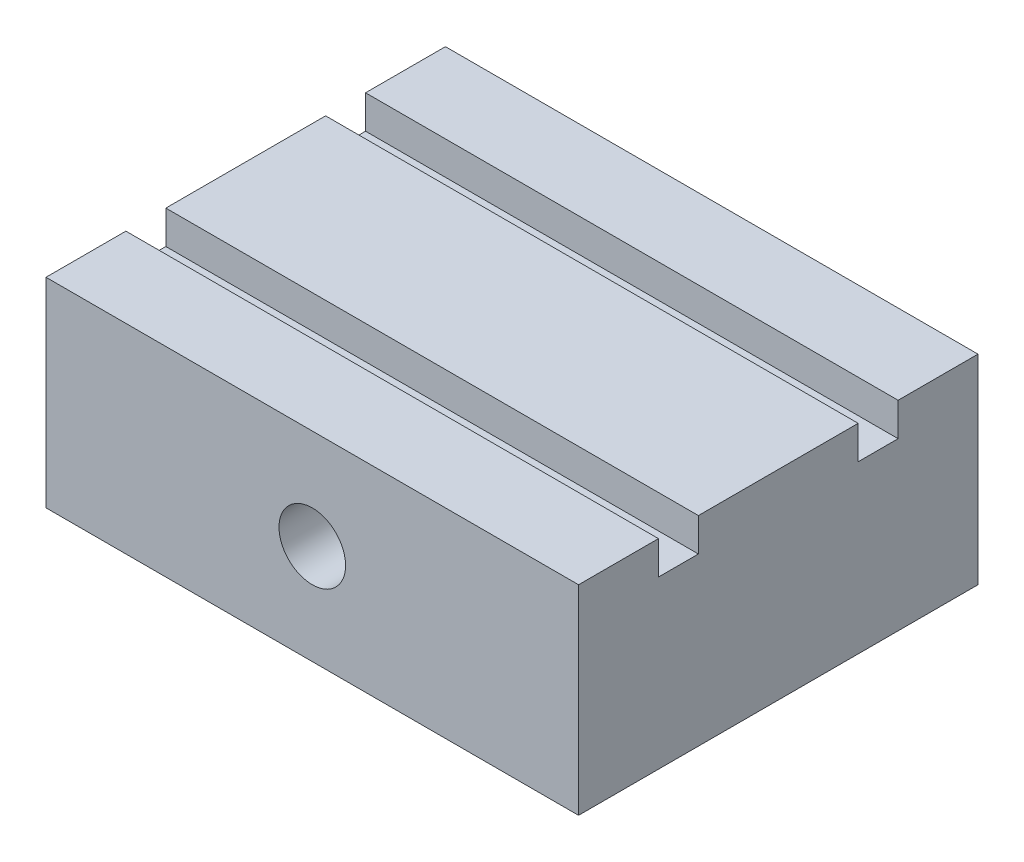
ISO-10303-21;
HEADER;
FILE_DESCRIPTION(('STEP AP214'),'2;1');
FILE_NAME('part.step','',(''),(''),'','','');
FILE_SCHEMA(('AUTOMOTIVE_DESIGN { 1 0 10303 214 1 1 1 1 }'));
ENDSEC;
DATA;
#1=APPLICATION_CONTEXT('core data for automotive mechanical design processes');
#2=APPLICATION_PROTOCOL_DEFINITION('international standard','automotive_design',2000,#1);
#3=PRODUCT_CONTEXT('',#1,'mechanical');
#4=PRODUCT('Part','Part','',(#3));
#5=PRODUCT_RELATED_PRODUCT_CATEGORY('part','',(#4));
#6=PRODUCT_DEFINITION_FORMATION('','',#4);
#7=PRODUCT_DEFINITION_CONTEXT('part definition',#1,'design');
#8=PRODUCT_DEFINITION('design','',#6,#7);
#9=PRODUCT_DEFINITION_SHAPE('','',#8);
#10=(LENGTH_UNIT() NAMED_UNIT(*) SI_UNIT(.MILLI.,.METRE.));
#11=(NAMED_UNIT(*) PLANE_ANGLE_UNIT() SI_UNIT($,.RADIAN.));
#12=(NAMED_UNIT(*) SI_UNIT($,.STERADIAN.) SOLID_ANGLE_UNIT());
#13=UNCERTAINTY_MEASURE_WITH_UNIT(LENGTH_MEASURE(1.E-05),#10,'distance_accuracy_value','');
#14=(GEOMETRIC_REPRESENTATION_CONTEXT(3) GLOBAL_UNCERTAINTY_ASSIGNED_CONTEXT((#13)) GLOBAL_UNIT_ASSIGNED_CONTEXT((#10,
#11,#12)) REPRESENTATION_CONTEXT('',''));
#15=CARTESIAN_POINT('',(0.,0.,0.));
#16=DIRECTION('',(0.,0.,1.));
#17=DIRECTION('',(1.,0.,0.));
#18=AXIS2_PLACEMENT_3D('',#15,#16,#17);
#19=CARTESIAN_POINT('',(0.,30.,0.));
#20=DIRECTION('',(0.,1.,0.));
#21=DIRECTION('',(0.,0.,1.));
#22=AXIS2_PLACEMENT_3D('',#19,#20,#21);
#23=PLANE('',#22);
#24=DIRECTION('',(-1.,0.,0.));
#25=VECTOR('',#24,1.);
#26=CARTESIAN_POINT('',(-40.,30.,-18.));
#27=LINE('',#26,#25);
#28=CARTESIAN_POINT('',(40.,30.,-18.));
#29=VERTEX_POINT('',#28);
#30=CARTESIAN_POINT('',(-40.,30.,-18.));
#31=VERTEX_POINT('',#30);
#32=EDGE_CURVE('E145',#29,#31,#27,.T.);
#33=ORIENTED_EDGE('',*,*,#32,.F.);
#34=DIRECTION('',(0.,0.,-1.));
#35=VECTOR('',#34,1.);
#36=CARTESIAN_POINT('',(40.,30.,-30.));
#37=LINE('',#36,#35);
#38=CARTESIAN_POINT('',(40.,30.,-30.));
#39=VERTEX_POINT('',#38);
#40=EDGE_CURVE('E211',#29,#39,#37,.T.);
#41=ORIENTED_EDGE('',*,*,#40,.T.);
#42=DIRECTION('',(-1.,0.,0.));
#43=VECTOR('',#42,1.);
#44=CARTESIAN_POINT('',(-40.,30.,-30.));
#45=LINE('',#44,#43);
#46=CARTESIAN_POINT('',(-40.,30.,-30.));
#47=VERTEX_POINT('',#46);
#48=EDGE_CURVE('E209',#39,#47,#45,.T.);
#49=ORIENTED_EDGE('',*,*,#48,.T.);
#50=DIRECTION('',(0.,0.,1.));
#51=VECTOR('',#50,1.);
#52=CARTESIAN_POINT('',(-40.,30.,-30.));
#53=LINE('',#52,#51);
#54=EDGE_CURVE('E215',#47,#31,#53,.T.);
#55=ORIENTED_EDGE('',*,*,#54,.T.);
#56=EDGE_LOOP('',(#33,#41,#49,#55));
#57=FACE_BOUND('',#56,.T.);
#58=ADVANCED_FACE('F38',(#57),#23,.T.);
#59=DIRECTION('',(1.,0.,0.));
#60=VECTOR('',#59,1.);
#61=CARTESIAN_POINT('',(-40.,30.,-12.));
#62=LINE('',#61,#60);
#63=CARTESIAN_POINT('',(-40.,30.,-12.));
#64=VERTEX_POINT('',#63);
#65=CARTESIAN_POINT('',(40.,30.,-12.));
#66=VERTEX_POINT('',#65);
#67=EDGE_CURVE('E185',#64,#66,#62,.T.);
#68=ORIENTED_EDGE('',*,*,#67,.F.);
#69=CARTESIAN_POINT('',(-40.,30.,12.));
#70=VERTEX_POINT('',#69);
#71=EDGE_CURVE('E151',#64,#70,#53,.T.);
#72=ORIENTED_EDGE('',*,*,#71,.T.);
#73=DIRECTION('',(-1.,0.,0.));
#74=VECTOR('',#73,1.);
#75=CARTESIAN_POINT('',(-40.,30.,12.));
#76=LINE('',#75,#74);
#77=CARTESIAN_POINT('',(40.,30.,12.));
#78=VERTEX_POINT('',#77);
#79=EDGE_CURVE('E166',#78,#70,#76,.T.);
#80=ORIENTED_EDGE('',*,*,#79,.F.);
#81=EDGE_CURVE('E210',#78,#66,#37,.T.);
#82=ORIENTED_EDGE('',*,*,#81,.T.);
#83=EDGE_LOOP('',(#68,#72,#80,#82));
#84=FACE_BOUND('',#83,.T.);
#85=ADVANCED_FACE('F269',(#84),#23,.T.);
#86=CARTESIAN_POINT('',(40.,30.,-30.));
#87=DIRECTION('',(-1.,0.,0.));
#88=DIRECTION('',(0.,0.,1.));
#89=AXIS2_PLACEMENT_3D('',#86,#87,#88);
#90=PLANE('',#89);
#91=ORIENTED_EDGE('',*,*,#40,.F.);
#92=DIRECTION('',(0.,1.,0.));
#93=VECTOR('',#92,1.);
#94=CARTESIAN_POINT('',(40.,25.,-18.));
#95=LINE('',#94,#93);
#96=CARTESIAN_POINT('',(40.,25.,-18.));
#97=VERTEX_POINT('',#96);
#98=EDGE_CURVE('E156',#97,#29,#95,.T.);
#99=ORIENTED_EDGE('',*,*,#98,.F.);
#100=DIRECTION('',(0.,0.,-1.));
#101=VECTOR('',#100,1.);
#102=CARTESIAN_POINT('',(40.,25.,-18.));
#103=LINE('',#102,#101);
#104=CARTESIAN_POINT('',(40.,25.,-12.));
#105=VERTEX_POINT('',#104);
#106=EDGE_CURVE('E134',#105,#97,#103,.T.);
#107=ORIENTED_EDGE('',*,*,#106,.F.);
#108=DIRECTION('',(0.,1.,0.));
#109=VECTOR('',#108,1.);
#110=CARTESIAN_POINT('',(40.,25.,-12.));
#111=LINE('',#110,#109);
#112=EDGE_CURVE('E130',#105,#66,#111,.T.);
#113=ORIENTED_EDGE('',*,*,#112,.T.);
#114=ORIENTED_EDGE('',*,*,#81,.F.);
#115=DIRECTION('',(0.,1.,0.));
#116=VECTOR('',#115,1.);
#117=CARTESIAN_POINT('',(40.,25.,12.));
#118=LINE('',#117,#116);
#119=CARTESIAN_POINT('',(40.,25.,12.));
#120=VERTEX_POINT('',#119);
#121=EDGE_CURVE('E186',#120,#78,#118,.T.);
#122=ORIENTED_EDGE('',*,*,#121,.F.);
#123=DIRECTION('',(0.,0.,-1.));
#124=VECTOR('',#123,1.);
#125=CARTESIAN_POINT('',(40.,25.,18.));
#126=LINE('',#125,#124);
#127=CARTESIAN_POINT('',(40.,25.,18.));
#128=VERTEX_POINT('',#127);
#129=EDGE_CURVE('E170',#128,#120,#126,.T.);
#130=ORIENTED_EDGE('',*,*,#129,.F.);
#131=DIRECTION('',(0.,1.,0.));
#132=VECTOR('',#131,1.);
#133=CARTESIAN_POINT('',(40.,25.,18.));
#134=LINE('',#133,#132);
#135=CARTESIAN_POINT('',(40.,30.,18.));
#136=VERTEX_POINT('',#135);
#137=EDGE_CURVE('E189',#128,#136,#134,.T.);
#138=ORIENTED_EDGE('',*,*,#137,.T.);
#139=CARTESIAN_POINT('',(40.,30.,30.));
#140=VERTEX_POINT('',#139);
#141=EDGE_CURVE('E205',#140,#136,#37,.T.);
#142=ORIENTED_EDGE('',*,*,#141,.F.);
#143=DIRECTION('',(0.,-1.,0.));
#144=VECTOR('',#143,1.);
#145=CARTESIAN_POINT('',(40.,30.,30.));
#146=LINE('',#145,#144);
#147=CARTESIAN_POINT('',(40.,0.,30.));
#148=VERTEX_POINT('',#147);
#149=EDGE_CURVE('E222',#140,#148,#146,.T.);
#150=ORIENTED_EDGE('',*,*,#149,.T.);
#151=DIRECTION('',(0.,0.,-1.));
#152=VECTOR('',#151,1.);
#153=CARTESIAN_POINT('',(40.,0.,-30.));
#154=LINE('',#153,#152);
#155=CARTESIAN_POINT('',(40.,0.,-30.));
#156=VERTEX_POINT('',#155);
#157=EDGE_CURVE('E199',#148,#156,#154,.T.);
#158=ORIENTED_EDGE('',*,*,#157,.T.);
#159=DIRECTION('',(0.,-1.,0.));
#160=VECTOR('',#159,1.);
#161=CARTESIAN_POINT('',(40.,30.,-30.));
#162=LINE('',#161,#160);
#163=EDGE_CURVE('E11',#39,#156,#162,.T.);
#164=ORIENTED_EDGE('',*,*,#163,.F.);
#165=EDGE_LOOP('',(#91,#99,#107,#113,#114,#122,#130,#138,#142,#150,#158,#164));
#166=FACE_BOUND('',#165,.T.);
#167=ADVANCED_FACE('F40',(#166),#90,.F.);
#168=CARTESIAN_POINT('',(-40.,30.,-30.));
#169=DIRECTION('',(0.,0.,1.));
#170=DIRECTION('',(1.,0.,0.));
#171=AXIS2_PLACEMENT_3D('',#168,#169,#170);
#172=PLANE('',#171);
#173=CARTESIAN_POINT('',(0.,15.,-30.));
#174=DIRECTION('',(0.,0.,1.));
#175=DIRECTION('',(1.,0.,0.));
#176=AXIS2_PLACEMENT_3D('',#173,#174,#175);
#177=CIRCLE('',#176,5.);
#178=CARTESIAN_POINT('',(4.99999999999999,15.,-30.));
#179=VERTEX_POINT('',#178);
#180=EDGE_CURVE('E195',#179,#179,#177,.T.);
#181=ORIENTED_EDGE('',*,*,#180,.T.);
#182=EDGE_LOOP('',(#181));
#183=FACE_BOUND('',#182,.T.);
#184=DIRECTION('',(-1.,0.,0.));
#185=VECTOR('',#184,1.);
#186=CARTESIAN_POINT('',(-40.,0.,-30.));
#187=LINE('',#186,#185);
#188=CARTESIAN_POINT('',(-40.,0.,-30.));
#189=VERTEX_POINT('',#188);
#190=EDGE_CURVE('E226',#156,#189,#187,.T.);
#191=ORIENTED_EDGE('',*,*,#190,.T.);
#192=DIRECTION('',(0.,-1.,0.));
#193=VECTOR('',#192,1.);
#194=CARTESIAN_POINT('',(-40.,30.,-30.));
#195=LINE('',#194,#193);
#196=EDGE_CURVE('E47',#47,#189,#195,.T.);
#197=ORIENTED_EDGE('',*,*,#196,.F.);
#198=ORIENTED_EDGE('',*,*,#48,.F.);
#199=ORIENTED_EDGE('',*,*,#163,.T.);
#200=EDGE_LOOP('',(#191,#197,#198,#199));
#201=FACE_BOUND('',#200,.T.);
#202=ADVANCED_FACE('F287',(#183,#201),#172,.F.);
#203=CARTESIAN_POINT('',(-40.,30.,-30.));
#204=DIRECTION('',(1.,0.,0.));
#205=DIRECTION('',(0.,0.,-1.));
#206=AXIS2_PLACEMENT_3D('',#203,#204,#205);
#207=PLANE('',#206);
#208=DIRECTION('',(0.,0.,1.));
#209=VECTOR('',#208,1.);
#210=CARTESIAN_POINT('',(-40.,25.,-18.));
#211=LINE('',#210,#209);
#212=CARTESIAN_POINT('',(-40.,25.,-18.));
#213=VERTEX_POINT('',#212);
#214=CARTESIAN_POINT('',(-40.,25.,-12.));
#215=VERTEX_POINT('',#214);
#216=EDGE_CURVE('E135',#213,#215,#211,.T.);
#217=ORIENTED_EDGE('',*,*,#216,.F.);
#218=DIRECTION('',(0.,1.,0.));
#219=VECTOR('',#218,1.);
#220=CARTESIAN_POINT('',(-40.,25.,-18.));
#221=LINE('',#220,#219);
#222=EDGE_CURVE('E204',#213,#31,#221,.T.);
#223=ORIENTED_EDGE('',*,*,#222,.T.);
#224=ORIENTED_EDGE('',*,*,#54,.F.);
#225=ORIENTED_EDGE('',*,*,#196,.T.);
#226=DIRECTION('',(0.,0.,1.));
#227=VECTOR('',#226,1.);
#228=CARTESIAN_POINT('',(-40.,0.,-30.));
#229=LINE('',#228,#227);
#230=CARTESIAN_POINT('',(-40.,0.,30.));
#231=VERTEX_POINT('',#230);
#232=EDGE_CURVE('E229',#189,#231,#229,.T.);
#233=ORIENTED_EDGE('',*,*,#232,.T.);
#234=DIRECTION('',(0.,-1.,0.));
#235=VECTOR('',#234,1.);
#236=CARTESIAN_POINT('',(-40.,30.,30.));
#237=LINE('',#236,#235);
#238=CARTESIAN_POINT('',(-40.,30.,30.));
#239=VERTEX_POINT('',#238);
#240=EDGE_CURVE('E238',#239,#231,#237,.T.);
#241=ORIENTED_EDGE('',*,*,#240,.F.);
#242=CARTESIAN_POINT('',(-40.,30.,18.));
#243=VERTEX_POINT('',#242);
#244=EDGE_CURVE('E214',#243,#239,#53,.T.);
#245=ORIENTED_EDGE('',*,*,#244,.F.);
#246=DIRECTION('',(0.,1.,0.));
#247=VECTOR('',#246,1.);
#248=CARTESIAN_POINT('',(-40.,25.,18.));
#249=LINE('',#248,#247);
#250=CARTESIAN_POINT('',(-40.,25.,18.));
#251=VERTEX_POINT('',#250);
#252=EDGE_CURVE('E54',#251,#243,#249,.T.);
#253=ORIENTED_EDGE('',*,*,#252,.F.);
#254=DIRECTION('',(0.,0.,1.));
#255=VECTOR('',#254,1.);
#256=CARTESIAN_POINT('',(-40.,25.,18.));
#257=LINE('',#256,#255);
#258=CARTESIAN_POINT('',(-40.,25.,12.));
#259=VERTEX_POINT('',#258);
#260=EDGE_CURVE('E161',#259,#251,#257,.T.);
#261=ORIENTED_EDGE('',*,*,#260,.F.);
#262=DIRECTION('',(0.,1.,0.));
#263=VECTOR('',#262,1.);
#264=CARTESIAN_POINT('',(-40.,25.,12.));
#265=LINE('',#264,#263);
#266=EDGE_CURVE('E182',#259,#70,#265,.T.);
#267=ORIENTED_EDGE('',*,*,#266,.T.);
#268=ORIENTED_EDGE('',*,*,#71,.F.);
#269=DIRECTION('',(0.,1.,0.));
#270=VECTOR('',#269,1.);
#271=CARTESIAN_POINT('',(-40.,25.,-12.));
#272=LINE('',#271,#270);
#273=EDGE_CURVE('E62',#215,#64,#272,.T.);
#274=ORIENTED_EDGE('',*,*,#273,.F.);
#275=EDGE_LOOP('',(#217,#223,#224,#225,#233,#241,#245,#253,#261,#267,#268,#274));
#276=FACE_BOUND('',#275,.T.);
#277=ADVANCED_FACE('F148',(#276),#207,.F.);
#278=CARTESIAN_POINT('',(-40.,30.,30.));
#279=DIRECTION('',(0.,0.,-1.));
#280=DIRECTION('',(-1.,0.,0.));
#281=AXIS2_PLACEMENT_3D('',#278,#279,#280);
#282=PLANE('',#281);
#283=CARTESIAN_POINT('',(0.,15.,30.));
#284=DIRECTION('',(0.,0.,1.));
#285=DIRECTION('',(1.,0.,0.));
#286=AXIS2_PLACEMENT_3D('',#283,#284,#285);
#287=CIRCLE('',#286,5.);
#288=CARTESIAN_POINT('',(4.99999999999999,15.,30.));
#289=VERTEX_POINT('',#288);
#290=EDGE_CURVE('E200',#289,#289,#287,.T.);
#291=ORIENTED_EDGE('',*,*,#290,.F.);
#292=EDGE_LOOP('',(#291));
#293=FACE_BOUND('',#292,.T.);
#294=DIRECTION('',(1.,0.,0.));
#295=VECTOR('',#294,1.);
#296=CARTESIAN_POINT('',(-40.,0.,30.));
#297=LINE('',#296,#295);
#298=EDGE_CURVE('E232',#231,#148,#297,.T.);
#299=ORIENTED_EDGE('',*,*,#298,.T.);
#300=ORIENTED_EDGE('',*,*,#149,.F.);
#301=DIRECTION('',(1.,0.,0.));
#302=VECTOR('',#301,1.);
#303=CARTESIAN_POINT('',(-40.,30.,30.));
#304=LINE('',#303,#302);
#305=EDGE_CURVE('E219',#239,#140,#304,.T.);
#306=ORIENTED_EDGE('',*,*,#305,.F.);
#307=ORIENTED_EDGE('',*,*,#240,.T.);
#308=EDGE_LOOP('',(#299,#300,#306,#307));
#309=FACE_BOUND('',#308,.T.);
#310=ADVANCED_FACE('F255',(#293,#309),#282,.F.);
#311=DIRECTION('',(1.,0.,0.));
#312=VECTOR('',#311,1.);
#313=CARTESIAN_POINT('',(-40.,30.,18.));
#314=LINE('',#313,#312);
#315=EDGE_CURVE('E177',#243,#136,#314,.T.);
#316=ORIENTED_EDGE('',*,*,#315,.F.);
#317=ORIENTED_EDGE('',*,*,#244,.T.);
#318=ORIENTED_EDGE('',*,*,#305,.T.);
#319=ORIENTED_EDGE('',*,*,#141,.T.);
#320=EDGE_LOOP('',(#316,#317,#318,#319));
#321=FACE_BOUND('',#320,.T.);
#322=ADVANCED_FACE('F263',(#321),#23,.T.);
#323=CARTESIAN_POINT('',(0.,0.,0.));
#324=DIRECTION('',(0.,1.,0.));
#325=DIRECTION('',(0.,0.,1.));
#326=AXIS2_PLACEMENT_3D('',#323,#324,#325);
#327=PLANE('',#326);
#328=ORIENTED_EDGE('',*,*,#157,.F.);
#329=ORIENTED_EDGE('',*,*,#298,.F.);
#330=ORIENTED_EDGE('',*,*,#232,.F.);
#331=ORIENTED_EDGE('',*,*,#190,.F.);
#332=EDGE_LOOP('',(#328,#329,#330,#331));
#333=FACE_BOUND('',#332,.T.);
#334=ADVANCED_FACE('F252',(#333),#327,.F.);
#335=CARTESIAN_POINT('',(0.,15.,-30.));
#336=DIRECTION('',(0.,0.,1.));
#337=DIRECTION('',(1.,0.,0.));
#338=AXIS2_PLACEMENT_3D('',#335,#336,#337);
#339=CYLINDRICAL_SURFACE('',#338,5.);
#340=ORIENTED_EDGE('',*,*,#180,.F.);
#341=EDGE_LOOP('',(#340));
#342=FACE_BOUND('',#341,.T.);
#343=ORIENTED_EDGE('',*,*,#290,.T.);
#344=EDGE_LOOP('',(#343));
#345=FACE_BOUND('',#344,.T.);
#346=ADVANCED_FACE('F310',(#342,#345),#339,.F.);
#347=CARTESIAN_POINT('',(-40.,25.,12.));
#348=DIRECTION('',(0.,0.,-1.));
#349=DIRECTION('',(-1.,0.,0.));
#350=AXIS2_PLACEMENT_3D('',#347,#348,#349);
#351=PLANE('',#350);
#352=ORIENTED_EDGE('',*,*,#79,.T.);
#353=ORIENTED_EDGE('',*,*,#266,.F.);
#354=DIRECTION('',(-1.,0.,0.));
#355=VECTOR('',#354,1.);
#356=CARTESIAN_POINT('',(-40.,25.,12.));
#357=LINE('',#356,#355);
#358=EDGE_CURVE('E173',#120,#259,#357,.T.);
#359=ORIENTED_EDGE('',*,*,#358,.F.);
#360=ORIENTED_EDGE('',*,*,#121,.T.);
#361=EDGE_LOOP('',(#352,#353,#359,#360));
#362=FACE_BOUND('',#361,.T.);
#363=ADVANCED_FACE('F319',(#362),#351,.F.);
#364=CARTESIAN_POINT('',(-40.,25.,18.));
#365=DIRECTION('',(0.,0.,1.));
#366=DIRECTION('',(1.,0.,0.));
#367=AXIS2_PLACEMENT_3D('',#364,#365,#366);
#368=PLANE('',#367);
#369=ORIENTED_EDGE('',*,*,#315,.T.);
#370=ORIENTED_EDGE('',*,*,#137,.F.);
#371=DIRECTION('',(1.,0.,0.));
#372=VECTOR('',#371,1.);
#373=CARTESIAN_POINT('',(-40.,25.,18.));
#374=LINE('',#373,#372);
#375=EDGE_CURVE('E165',#251,#128,#374,.T.);
#376=ORIENTED_EDGE('',*,*,#375,.F.);
#377=ORIENTED_EDGE('',*,*,#252,.T.);
#378=EDGE_LOOP('',(#369,#370,#376,#377));
#379=FACE_BOUND('',#378,.T.);
#380=ADVANCED_FACE('F324',(#379),#368,.F.);
#381=CARTESIAN_POINT('',(0.,25.,0.));
#382=DIRECTION('',(0.,-1.,0.));
#383=DIRECTION('',(0.,0.,-1.));
#384=AXIS2_PLACEMENT_3D('',#381,#382,#383);
#385=PLANE('',#384);
#386=ORIENTED_EDGE('',*,*,#260,.T.);
#387=ORIENTED_EDGE('',*,*,#375,.T.);
#388=ORIENTED_EDGE('',*,*,#129,.T.);
#389=ORIENTED_EDGE('',*,*,#358,.T.);
#390=EDGE_LOOP('',(#386,#387,#388,#389));
#391=FACE_BOUND('',#390,.T.);
#392=ADVANCED_FACE('F330',(#391),#385,.F.);
#393=CARTESIAN_POINT('',(-40.,25.,-18.));
#394=DIRECTION('',(0.,0.,-1.));
#395=DIRECTION('',(-1.,0.,0.));
#396=AXIS2_PLACEMENT_3D('',#393,#394,#395);
#397=PLANE('',#396);
#398=ORIENTED_EDGE('',*,*,#32,.T.);
#399=ORIENTED_EDGE('',*,*,#222,.F.);
#400=DIRECTION('',(-1.,0.,0.));
#401=VECTOR('',#400,1.);
#402=CARTESIAN_POINT('',(-40.,25.,-18.));
#403=LINE('',#402,#401);
#404=EDGE_CURVE('E141',#97,#213,#403,.T.);
#405=ORIENTED_EDGE('',*,*,#404,.F.);
#406=ORIENTED_EDGE('',*,*,#98,.T.);
#407=EDGE_LOOP('',(#398,#399,#405,#406));
#408=FACE_BOUND('',#407,.T.);
#409=ADVANCED_FACE('F283',(#408),#397,.F.);
#410=CARTESIAN_POINT('',(-40.,25.,-12.));
#411=DIRECTION('',(0.,0.,1.));
#412=DIRECTION('',(1.,0.,0.));
#413=AXIS2_PLACEMENT_3D('',#410,#411,#412);
#414=PLANE('',#413);
#415=ORIENTED_EDGE('',*,*,#67,.T.);
#416=ORIENTED_EDGE('',*,*,#112,.F.);
#417=DIRECTION('',(1.,0.,0.));
#418=VECTOR('',#417,1.);
#419=CARTESIAN_POINT('',(-40.,25.,-12.));
#420=LINE('',#419,#418);
#421=EDGE_CURVE('E126',#215,#105,#420,.T.);
#422=ORIENTED_EDGE('',*,*,#421,.F.);
#423=ORIENTED_EDGE('',*,*,#273,.T.);
#424=EDGE_LOOP('',(#415,#416,#422,#423));
#425=FACE_BOUND('',#424,.T.);
#426=ADVANCED_FACE('F128',(#425),#414,.F.);
#427=CARTESIAN_POINT('',(0.,25.,0.));
#428=DIRECTION('',(0.,1.,0.));
#429=DIRECTION('',(0.,0.,1.));
#430=AXIS2_PLACEMENT_3D('',#427,#428,#429);
#431=PLANE('',#430);
#432=ORIENTED_EDGE('',*,*,#216,.T.);
#433=ORIENTED_EDGE('',*,*,#421,.T.);
#434=ORIENTED_EDGE('',*,*,#106,.T.);
#435=ORIENTED_EDGE('',*,*,#404,.T.);
#436=EDGE_LOOP('',(#432,#433,#434,#435));
#437=FACE_BOUND('',#436,.T.);
#438=ADVANCED_FACE('F139',(#437),#431,.T.);
#439=CLOSED_SHELL('',(#58,#85,#167,#202,#277,#310,#322,#334,#346,#363,#380,#392,#409,#426,#438));
#440=MANIFOLD_SOLID_BREP('B2',#439);
#441=ADVANCED_BREP_SHAPE_REPRESENTATION('',(#18,#440),#14);
#442=SHAPE_DEFINITION_REPRESENTATION(#9,#441);
ENDSEC;
END-ISO-10303-21;
